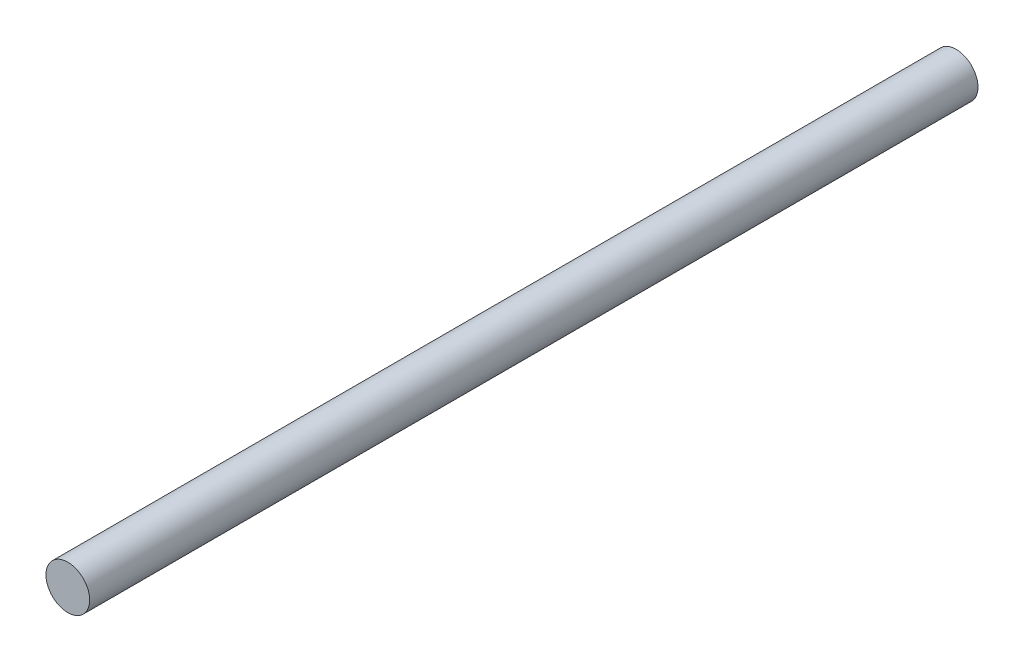
ISO-10303-21;
HEADER;
FILE_DESCRIPTION(('STEP AP214'),'2;1');
FILE_NAME('part.step','',(''),(''),'','','');
FILE_SCHEMA(('AUTOMOTIVE_DESIGN { 1 0 10303 214 1 1 1 1 }'));
ENDSEC;
DATA;
#1=APPLICATION_CONTEXT('core data for automotive mechanical design processes');
#2=APPLICATION_PROTOCOL_DEFINITION('international standard','automotive_design',2000,#1);
#3=PRODUCT_CONTEXT('',#1,'mechanical');
#4=PRODUCT('Part','Part','',(#3));
#5=PRODUCT_RELATED_PRODUCT_CATEGORY('part','',(#4));
#6=PRODUCT_DEFINITION_FORMATION('','',#4);
#7=PRODUCT_DEFINITION_CONTEXT('part definition',#1,'design');
#8=PRODUCT_DEFINITION('design','',#6,#7);
#9=PRODUCT_DEFINITION_SHAPE('','',#8);
#10=(LENGTH_UNIT() NAMED_UNIT(*) SI_UNIT(.MILLI.,.METRE.));
#11=(NAMED_UNIT(*) PLANE_ANGLE_UNIT() SI_UNIT($,.RADIAN.));
#12=(NAMED_UNIT(*) SI_UNIT($,.STERADIAN.) SOLID_ANGLE_UNIT());
#13=UNCERTAINTY_MEASURE_WITH_UNIT(LENGTH_MEASURE(1.E-05),#10,'distance_accuracy_value','');
#14=(GEOMETRIC_REPRESENTATION_CONTEXT(3) GLOBAL_UNCERTAINTY_ASSIGNED_CONTEXT((#13)) GLOBAL_UNIT_ASSIGNED_CONTEXT((#10,
#11,#12)) REPRESENTATION_CONTEXT('',''));
#15=CARTESIAN_POINT('',(0.,0.,0.));
#16=DIRECTION('',(0.,0.,1.));
#17=DIRECTION('',(1.,0.,0.));
#18=AXIS2_PLACEMENT_3D('',#15,#16,#17);
#19=CARTESIAN_POINT('',(0.,0.,65.));
#20=DIRECTION('',(0.,0.,-1.));
#21=DIRECTION('',(-1.,0.,0.));
#22=AXIS2_PLACEMENT_3D('',#19,#20,#21);
#23=CYLINDRICAL_SURFACE('',#22,1.6);
#24=CARTESIAN_POINT('',(0.,0.,65.));
#25=DIRECTION('',(0.,0.,1.));
#26=DIRECTION('',(1.,0.,0.));
#27=AXIS2_PLACEMENT_3D('',#24,#25,#26);
#28=CIRCLE('',#27,1.6);
#29=CARTESIAN_POINT('',(1.6,0.,65.));
#30=VERTEX_POINT('',#29);
#31=EDGE_CURVE('E10',#30,#30,#28,.T.);
#32=ORIENTED_EDGE('',*,*,#31,.F.);
#33=EDGE_LOOP('',(#32));
#34=FACE_BOUND('',#33,.T.);
#35=CARTESIAN_POINT('',(0.,0.,0.));
#36=DIRECTION('',(0.,0.,1.));
#37=DIRECTION('',(1.,0.,0.));
#38=AXIS2_PLACEMENT_3D('',#35,#36,#37);
#39=CIRCLE('',#38,1.6);
#40=CARTESIAN_POINT('',(1.6,0.,0.));
#41=VERTEX_POINT('',#40);
#42=EDGE_CURVE('E34',#41,#41,#39,.T.);
#43=ORIENTED_EDGE('',*,*,#42,.T.);
#44=EDGE_LOOP('',(#43));
#45=FACE_BOUND('',#44,.T.);
#46=ADVANCED_FACE('F31',(#34,#45),#23,.T.);
#47=CARTESIAN_POINT('',(0.,0.,65.));
#48=DIRECTION('',(0.,0.,1.));
#49=DIRECTION('',(1.,0.,0.));
#50=AXIS2_PLACEMENT_3D('',#47,#48,#49);
#51=PLANE('',#50);
#52=ORIENTED_EDGE('',*,*,#31,.T.);
#53=EDGE_LOOP('',(#52));
#54=FACE_BOUND('',#53,.T.);
#55=ADVANCED_FACE('F46',(#54),#51,.T.);
#56=CARTESIAN_POINT('',(0.,0.,0.));
#57=DIRECTION('',(0.,0.,1.));
#58=DIRECTION('',(1.,0.,0.));
#59=AXIS2_PLACEMENT_3D('',#56,#57,#58);
#60=PLANE('',#59);
#61=ORIENTED_EDGE('',*,*,#42,.F.);
#62=EDGE_LOOP('',(#61));
#63=FACE_BOUND('',#62,.T.);
#64=ADVANCED_FACE('F44',(#63),#60,.F.);
#65=CLOSED_SHELL('',(#46,#55,#64));
#66=MANIFOLD_SOLID_BREP('B2',#65);
#67=ADVANCED_BREP_SHAPE_REPRESENTATION('',(#18,#66),#14);
#68=SHAPE_DEFINITION_REPRESENTATION(#9,#67);
ENDSEC;
END-ISO-10303-21;
